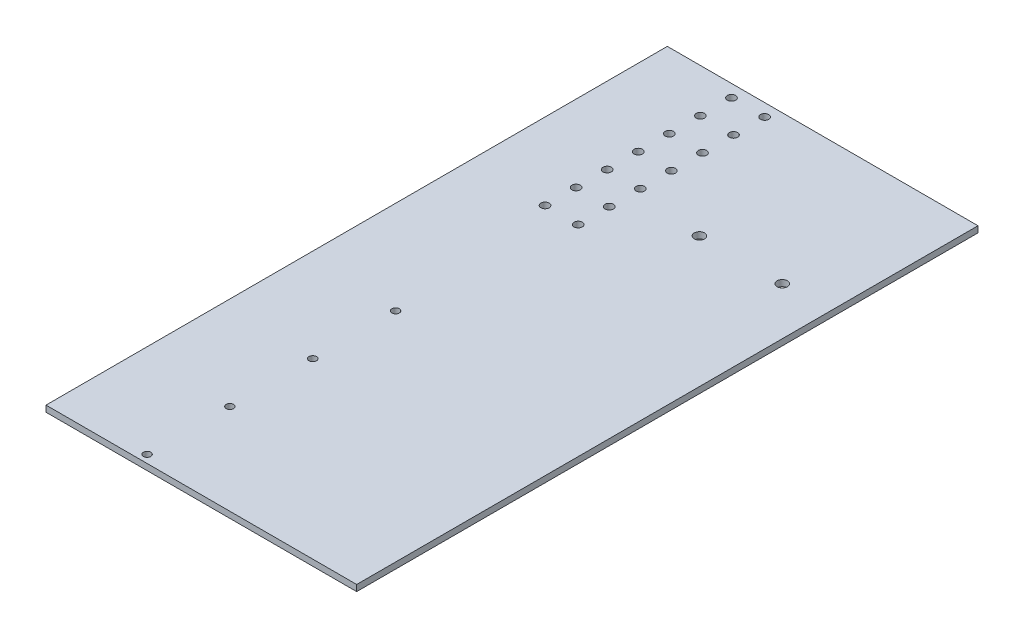
ISO-10303-21;
HEADER;
FILE_DESCRIPTION(('STEP AP214'),'2;1');
FILE_NAME('part.step','',(''),(''),'','','');
FILE_SCHEMA(('AUTOMOTIVE_DESIGN { 1 0 10303 214 1 1 1 1 }'));
ENDSEC;
DATA;
#1=APPLICATION_CONTEXT('core data for automotive mechanical design processes');
#2=APPLICATION_PROTOCOL_DEFINITION('international standard','automotive_design',2000,#1);
#3=PRODUCT_CONTEXT('',#1,'mechanical');
#4=PRODUCT('Part','Part','',(#3));
#5=PRODUCT_RELATED_PRODUCT_CATEGORY('part','',(#4));
#6=PRODUCT_DEFINITION_FORMATION('','',#4);
#7=PRODUCT_DEFINITION_CONTEXT('part definition',#1,'design');
#8=PRODUCT_DEFINITION('design','',#6,#7);
#9=PRODUCT_DEFINITION_SHAPE('','',#8);
#10=(LENGTH_UNIT() NAMED_UNIT(*) SI_UNIT(.MILLI.,.METRE.));
#11=(NAMED_UNIT(*) PLANE_ANGLE_UNIT() SI_UNIT($,.RADIAN.));
#12=(NAMED_UNIT(*) SI_UNIT($,.STERADIAN.) SOLID_ANGLE_UNIT());
#13=UNCERTAINTY_MEASURE_WITH_UNIT(LENGTH_MEASURE(1.E-05),#10,'distance_accuracy_value','');
#14=(GEOMETRIC_REPRESENTATION_CONTEXT(3) GLOBAL_UNCERTAINTY_ASSIGNED_CONTEXT((#13)) GLOBAL_UNIT_ASSIGNED_CONTEXT((#10,
#11,#12)) REPRESENTATION_CONTEXT('',''));
#15=CARTESIAN_POINT('',(0.,0.,0.));
#16=DIRECTION('',(0.,0.,1.));
#17=DIRECTION('',(1.,0.,0.));
#18=AXIS2_PLACEMENT_3D('',#15,#16,#17);
#19=CARTESIAN_POINT('',(75.,3.,150.));
#20=DIRECTION('',(-1.,0.,0.));
#21=DIRECTION('',(0.,0.,1.));
#22=AXIS2_PLACEMENT_3D('',#19,#20,#21);
#23=PLANE('',#22);
#24=DIRECTION('',(0.,0.,-1.));
#25=VECTOR('',#24,1.);
#26=CARTESIAN_POINT('',(75.,0.,150.));
#27=LINE('',#26,#25);
#28=CARTESIAN_POINT('',(75.,0.,150.));
#29=VERTEX_POINT('',#28);
#30=CARTESIAN_POINT('',(75.,0.,-150.));
#31=VERTEX_POINT('',#30);
#32=EDGE_CURVE('E109',#29,#31,#27,.T.);
#33=ORIENTED_EDGE('',*,*,#32,.T.);
#34=DIRECTION('',(0.,-1.,0.));
#35=VECTOR('',#34,1.);
#36=CARTESIAN_POINT('',(75.,3.,-150.));
#37=LINE('',#36,#35);
#38=CARTESIAN_POINT('',(75.,3.,-150.));
#39=VERTEX_POINT('',#38);
#40=EDGE_CURVE('E11',#39,#31,#37,.T.);
#41=ORIENTED_EDGE('',*,*,#40,.F.);
#42=DIRECTION('',(0.,0.,-1.));
#43=VECTOR('',#42,1.);
#44=CARTESIAN_POINT('',(75.,3.,150.));
#45=LINE('',#44,#43);
#46=CARTESIAN_POINT('',(75.,3.,150.));
#47=VERTEX_POINT('',#46);
#48=EDGE_CURVE('E92',#47,#39,#45,.T.);
#49=ORIENTED_EDGE('',*,*,#48,.F.);
#50=DIRECTION('',(0.,-1.,0.));
#51=VECTOR('',#50,1.);
#52=CARTESIAN_POINT('',(75.,3.,150.));
#53=LINE('',#52,#51);
#54=EDGE_CURVE('E105',#47,#29,#53,.T.);
#55=ORIENTED_EDGE('',*,*,#54,.T.);
#56=EDGE_LOOP('',(#33,#41,#49,#55));
#57=FACE_BOUND('',#56,.T.);
#58=ADVANCED_FACE('F38',(#57),#23,.F.);
#59=CARTESIAN_POINT('',(-75.,3.,-150.));
#60=DIRECTION('',(0.,0.,1.));
#61=DIRECTION('',(1.,0.,0.));
#62=AXIS2_PLACEMENT_3D('',#59,#60,#61);
#63=PLANE('',#62);
#64=DIRECTION('',(-1.,0.,0.));
#65=VECTOR('',#64,1.);
#66=CARTESIAN_POINT('',(-75.,0.,-150.));
#67=LINE('',#66,#65);
#68=CARTESIAN_POINT('',(-75.,0.,-150.));
#69=VERTEX_POINT('',#68);
#70=EDGE_CURVE('E97',#31,#69,#67,.T.);
#71=ORIENTED_EDGE('',*,*,#70,.T.);
#72=DIRECTION('',(0.,-1.,0.));
#73=VECTOR('',#72,1.);
#74=CARTESIAN_POINT('',(-75.,3.,-150.));
#75=LINE('',#74,#73);
#76=CARTESIAN_POINT('',(-75.,3.,-150.));
#77=VERTEX_POINT('',#76);
#78=EDGE_CURVE('E48',#77,#69,#75,.T.);
#79=ORIENTED_EDGE('',*,*,#78,.F.);
#80=DIRECTION('',(-1.,0.,0.));
#81=VECTOR('',#80,1.);
#82=CARTESIAN_POINT('',(-75.,3.,-150.));
#83=LINE('',#82,#81);
#84=EDGE_CURVE('E87',#39,#77,#83,.T.);
#85=ORIENTED_EDGE('',*,*,#84,.F.);
#86=ORIENTED_EDGE('',*,*,#40,.T.);
#87=EDGE_LOOP('',(#71,#79,#85,#86));
#88=FACE_BOUND('',#87,.T.);
#89=ADVANCED_FACE('F96',(#88),#63,.F.);
#90=CARTESIAN_POINT('',(-75.,3.,150.));
#91=DIRECTION('',(1.,0.,0.));
#92=DIRECTION('',(0.,0.,-1.));
#93=AXIS2_PLACEMENT_3D('',#90,#91,#92);
#94=PLANE('',#93);
#95=DIRECTION('',(0.,0.,1.));
#96=VECTOR('',#95,1.);
#97=CARTESIAN_POINT('',(-75.,0.,150.));
#98=LINE('',#97,#96);
#99=CARTESIAN_POINT('',(-75.,0.,150.));
#100=VERTEX_POINT('',#99);
#101=EDGE_CURVE('E74',#69,#100,#98,.T.);
#102=ORIENTED_EDGE('',*,*,#101,.T.);
#103=DIRECTION('',(0.,-1.,0.));
#104=VECTOR('',#103,1.);
#105=CARTESIAN_POINT('',(-75.,3.,150.));
#106=LINE('',#105,#104);
#107=CARTESIAN_POINT('',(-75.,3.,150.));
#108=VERTEX_POINT('',#107);
#109=EDGE_CURVE('E99',#108,#100,#106,.T.);
#110=ORIENTED_EDGE('',*,*,#109,.F.);
#111=DIRECTION('',(0.,0.,1.));
#112=VECTOR('',#111,1.);
#113=CARTESIAN_POINT('',(-75.,3.,150.));
#114=LINE('',#113,#112);
#115=EDGE_CURVE('E90',#77,#108,#114,.T.);
#116=ORIENTED_EDGE('',*,*,#115,.F.);
#117=ORIENTED_EDGE('',*,*,#78,.T.);
#118=EDGE_LOOP('',(#102,#110,#116,#117));
#119=FACE_BOUND('',#118,.T.);
#120=ADVANCED_FACE('F101',(#119),#94,.F.);
#121=CARTESIAN_POINT('',(-75.,3.,150.));
#122=DIRECTION('',(0.,0.,-1.));
#123=DIRECTION('',(-1.,0.,0.));
#124=AXIS2_PLACEMENT_3D('',#121,#122,#123);
#125=PLANE('',#124);
#126=DIRECTION('',(1.,0.,0.));
#127=VECTOR('',#126,1.);
#128=CARTESIAN_POINT('',(-75.,0.,150.));
#129=LINE('',#128,#127);
#130=EDGE_CURVE('E80',#100,#29,#129,.T.);
#131=ORIENTED_EDGE('',*,*,#130,.T.);
#132=ORIENTED_EDGE('',*,*,#54,.F.);
#133=DIRECTION('',(1.,0.,0.));
#134=VECTOR('',#133,1.);
#135=CARTESIAN_POINT('',(-75.,3.,150.));
#136=LINE('',#135,#134);
#137=EDGE_CURVE('E57',#108,#47,#136,.T.);
#138=ORIENTED_EDGE('',*,*,#137,.F.);
#139=ORIENTED_EDGE('',*,*,#109,.T.);
#140=EDGE_LOOP('',(#131,#132,#138,#139));
#141=FACE_BOUND('',#140,.T.);
#142=ADVANCED_FACE('F274',(#141),#125,.F.);
#143=CARTESIAN_POINT('',(0.,3.,0.));
#144=DIRECTION('',(0.,-1.,0.));
#145=DIRECTION('',(0.,0.,-1.));
#146=AXIS2_PLACEMENT_3D('',#143,#144,#145);
#147=PLANE('',#146);
#148=CARTESIAN_POINT('',(-22.0060480921032,3.,-98.9680858011264));
#149=DIRECTION('',(0.,1.,0.));
#150=DIRECTION('',(0.,0.,1.));
#151=AXIS2_PLACEMENT_3D('',#148,#149,#150);
#152=CIRCLE('',#151,2.);
#153=CARTESIAN_POINT('',(-22.0060480921032,3.,-96.9680858011263));
#154=VERTEX_POINT('',#153);
#155=EDGE_CURVE('E487',#154,#154,#152,.T.);
#156=ORIENTED_EDGE('',*,*,#155,.F.);
#157=EDGE_LOOP('',(#156));
#158=FACE_BOUND('',#157,.T.);
#159=CARTESIAN_POINT('',(-38.0060480921033,3.,-113.968085801126));
#160=DIRECTION('',(0.,1.,0.));
#161=DIRECTION('',(0.,0.,1.));
#162=AXIS2_PLACEMENT_3D('',#159,#160,#161);
#163=CIRCLE('',#162,2.);
#164=CARTESIAN_POINT('',(-38.0060480921033,3.,-111.968085801126));
#165=VERTEX_POINT('',#164);
#166=EDGE_CURVE('E490',#165,#165,#163,.T.);
#167=ORIENTED_EDGE('',*,*,#166,.F.);
#168=EDGE_LOOP('',(#167));
#169=FACE_BOUND('',#168,.T.);
#170=CARTESIAN_POINT('',(-22.0060480921033,3.,-113.968085801126));
#171=DIRECTION('',(0.,1.,0.));
#172=DIRECTION('',(0.,0.,1.));
#173=AXIS2_PLACEMENT_3D('',#170,#171,#172);
#174=CIRCLE('',#173,2.);
#175=CARTESIAN_POINT('',(-22.0060480921033,3.,-111.968085801126));
#176=VERTEX_POINT('',#175);
#177=EDGE_CURVE('E498',#176,#176,#174,.T.);
#178=ORIENTED_EDGE('',*,*,#177,.F.);
#179=EDGE_LOOP('',(#178));
#180=FACE_BOUND('',#179,.T.);
#181=CARTESIAN_POINT('',(-38.0060480921034,3.,-128.968085801126));
#182=DIRECTION('',(0.,1.,0.));
#183=DIRECTION('',(0.,0.,1.));
#184=AXIS2_PLACEMENT_3D('',#181,#182,#183);
#185=CIRCLE('',#184,2.);
#186=CARTESIAN_POINT('',(-38.0060480921034,3.,-126.968085801126));
#187=VERTEX_POINT('',#186);
#188=EDGE_CURVE('E501',#187,#187,#185,.T.);
#189=ORIENTED_EDGE('',*,*,#188,.F.);
#190=EDGE_LOOP('',(#189));
#191=FACE_BOUND('',#190,.T.);
#192=CARTESIAN_POINT('',(-22.0060480921031,3.,-68.9680858011264));
#193=DIRECTION('',(0.,1.,0.));
#194=DIRECTION('',(0.,0.,1.));
#195=AXIS2_PLACEMENT_3D('',#192,#193,#194);
#196=CIRCLE('',#195,2.);
#197=CARTESIAN_POINT('',(-22.0060480921031,3.,-66.9680858011263));
#198=VERTEX_POINT('',#197);
#199=EDGE_CURVE('E508',#198,#198,#196,.T.);
#200=ORIENTED_EDGE('',*,*,#199,.F.);
#201=EDGE_LOOP('',(#200));
#202=FACE_BOUND('',#201,.T.);
#203=CARTESIAN_POINT('',(-38.0060480921032,3.,-83.9680858011264));
#204=DIRECTION('',(0.,1.,0.));
#205=DIRECTION('',(0.,0.,1.));
#206=AXIS2_PLACEMENT_3D('',#203,#204,#205);
#207=CIRCLE('',#206,2.);
#208=CARTESIAN_POINT('',(-38.0060480921032,3.,-81.9680858011263));
#209=VERTEX_POINT('',#208);
#210=EDGE_CURVE('E506',#209,#209,#207,.T.);
#211=ORIENTED_EDGE('',*,*,#210,.F.);
#212=EDGE_LOOP('',(#211));
#213=FACE_BOUND('',#212,.T.);
#214=CARTESIAN_POINT('',(-22.0060480921032,3.,-83.9680858011264));
#215=DIRECTION('',(0.,1.,0.));
#216=DIRECTION('',(0.,0.,1.));
#217=AXIS2_PLACEMENT_3D('',#214,#215,#216);
#218=CIRCLE('',#217,2.);
#219=CARTESIAN_POINT('',(-22.0060480921032,3.,-81.9680858011263));
#220=VERTEX_POINT('',#219);
#221=EDGE_CURVE('E495',#220,#220,#218,.T.);
#222=ORIENTED_EDGE('',*,*,#221,.F.);
#223=EDGE_LOOP('',(#222));
#224=FACE_BOUND('',#223,.T.);
#225=CARTESIAN_POINT('',(-38.0060480921032,3.,-98.9680858011264));
#226=DIRECTION('',(0.,1.,0.));
#227=DIRECTION('',(0.,0.,1.));
#228=AXIS2_PLACEMENT_3D('',#225,#226,#227);
#229=CIRCLE('',#228,2.);
#230=CARTESIAN_POINT('',(-38.0060480921032,3.,-96.9680858011263));
#231=VERTEX_POINT('',#230);
#232=EDGE_CURVE('E489',#231,#231,#229,.T.);
#233=ORIENTED_EDGE('',*,*,#232,.F.);
#234=EDGE_LOOP('',(#233));
#235=FACE_BOUND('',#234,.T.);
#236=CARTESIAN_POINT('',(-22.0060480921034,3.,-143.968085801126));
#237=DIRECTION('',(0.,1.,0.));
#238=DIRECTION('',(0.,0.,1.));
#239=AXIS2_PLACEMENT_3D('',#236,#237,#238);
#240=CIRCLE('',#239,2.);
#241=CARTESIAN_POINT('',(-22.0060480921034,3.,-141.968085801126));
#242=VERTEX_POINT('',#241);
#243=EDGE_CURVE('E546',#242,#242,#240,.T.);
#244=ORIENTED_EDGE('',*,*,#243,.F.);
#245=EDGE_LOOP('',(#244));
#246=FACE_BOUND('',#245,.T.);
#247=CARTESIAN_POINT('',(-38.0060480921034,3.,-143.968085801126));
#248=DIRECTION('',(0.,1.,0.));
#249=DIRECTION('',(0.,0.,1.));
#250=AXIS2_PLACEMENT_3D('',#247,#248,#249);
#251=CIRCLE('',#250,2.);
#252=CARTESIAN_POINT('',(-38.0060480921034,3.,-141.968085801126));
#253=VERTEX_POINT('',#252);
#254=EDGE_CURVE('E550',#253,#253,#251,.T.);
#255=ORIENTED_EDGE('',*,*,#254,.F.);
#256=EDGE_LOOP('',(#255));
#257=FACE_BOUND('',#256,.T.);
#258=CARTESIAN_POINT('',(-22.0060480921033,3.,-128.968085801126));
#259=DIRECTION('',(0.,1.,0.));
#260=DIRECTION('',(0.,0.,1.));
#261=AXIS2_PLACEMENT_3D('',#258,#259,#260);
#262=CIRCLE('',#261,2.);
#263=CARTESIAN_POINT('',(-22.0060480921033,3.,-126.968085801126));
#264=VERTEX_POINT('',#263);
#265=EDGE_CURVE('E553',#264,#264,#262,.T.);
#266=ORIENTED_EDGE('',*,*,#265,.F.);
#267=EDGE_LOOP('',(#266));
#268=FACE_BOUND('',#267,.T.);
#269=CARTESIAN_POINT('',(-38.0060480921031,3.,-68.9680858011264));
#270=DIRECTION('',(0.,1.,0.));
#271=DIRECTION('',(0.,0.,1.));
#272=AXIS2_PLACEMENT_3D('',#269,#270,#271);
#273=CIRCLE('',#272,2.);
#274=CARTESIAN_POINT('',(-38.0060480921031,3.,-66.9680858011263));
#275=VERTEX_POINT('',#274);
#276=EDGE_CURVE('E157',#275,#275,#273,.T.);
#277=ORIENTED_EDGE('',*,*,#276,.F.);
#278=EDGE_LOOP('',(#277));
#279=FACE_BOUND('',#278,.T.);
#280=CARTESIAN_POINT('',(-38.0060480921031,3.,-53.9680858011264));
#281=DIRECTION('',(0.,1.,0.));
#282=DIRECTION('',(0.,0.,1.));
#283=AXIS2_PLACEMENT_3D('',#280,#281,#282);
#284=CIRCLE('',#283,2.);
#285=CARTESIAN_POINT('',(-38.0060480921031,3.,-51.9680858011264));
#286=VERTEX_POINT('',#285);
#287=EDGE_CURVE('E147',#286,#286,#284,.T.);
#288=ORIENTED_EDGE('',*,*,#287,.F.);
#289=EDGE_LOOP('',(#288));
#290=FACE_BOUND('',#289,.T.);
#291=CARTESIAN_POINT('',(-22.0060480921031,3.,-53.9680858011264));
#292=DIRECTION('',(0.,1.,0.));
#293=DIRECTION('',(0.,0.,1.));
#294=AXIS2_PLACEMENT_3D('',#291,#292,#293);
#295=CIRCLE('',#294,2.);
#296=CARTESIAN_POINT('',(-22.0060480921031,3.,-51.9680858011264));
#297=VERTEX_POINT('',#296);
#298=EDGE_CURVE('E199',#297,#297,#295,.T.);
#299=ORIENTED_EDGE('',*,*,#298,.F.);
#300=EDGE_LOOP('',(#299));
#301=FACE_BOUND('',#300,.T.);
#302=CARTESIAN_POINT('',(-30.0060480921029,3.,146.200000000003));
#303=DIRECTION('',(0.,1.,0.));
#304=DIRECTION('',(0.,0.,1.));
#305=AXIS2_PLACEMENT_3D('',#302,#303,#304);
#306=CIRCLE('',#305,1.79999999999999);
#307=CARTESIAN_POINT('',(-30.0060480921029,3.,148.000000000003));
#308=VERTEX_POINT('',#307);
#309=EDGE_CURVE('E129',#308,#308,#306,.T.);
#310=ORIENTED_EDGE('',*,*,#309,.F.);
#311=EDGE_LOOP('',(#310));
#312=FACE_BOUND('',#311,.T.);
#313=CARTESIAN_POINT('',(-30.0060480921033,3.,106.200000000003));
#314=DIRECTION('',(0.,1.,0.));
#315=DIRECTION('',(0.,0.,1.));
#316=AXIS2_PLACEMENT_3D('',#313,#314,#315);
#317=CIRCLE('',#316,1.79999999999999);
#318=CARTESIAN_POINT('',(-30.0060480921033,3.,108.000000000003));
#319=VERTEX_POINT('',#318);
#320=EDGE_CURVE('E215',#319,#319,#317,.T.);
#321=ORIENTED_EDGE('',*,*,#320,.F.);
#322=EDGE_LOOP('',(#321));
#323=FACE_BOUND('',#322,.T.);
#324=CARTESIAN_POINT('',(-30.0060480921037,3.,66.2000000000026));
#325=DIRECTION('',(0.,1.,0.));
#326=DIRECTION('',(0.,0.,1.));
#327=AXIS2_PLACEMENT_3D('',#324,#325,#326);
#328=CIRCLE('',#327,1.79999999999999);
#329=CARTESIAN_POINT('',(-30.0060480921037,3.,68.0000000000026));
#330=VERTEX_POINT('',#329);
#331=EDGE_CURVE('E219',#330,#330,#328,.T.);
#332=ORIENTED_EDGE('',*,*,#331,.F.);
#333=EDGE_LOOP('',(#332));
#334=FACE_BOUND('',#333,.T.);
#335=CARTESIAN_POINT('',(-30.0060480921042,3.,26.2000000000026));
#336=DIRECTION('',(0.,1.,0.));
#337=DIRECTION('',(0.,0.,1.));
#338=AXIS2_PLACEMENT_3D('',#335,#336,#337);
#339=CIRCLE('',#338,1.79999999999999);
#340=CARTESIAN_POINT('',(-30.0060480921042,3.,28.0000000000026));
#341=VERTEX_POINT('',#340);
#342=EDGE_CURVE('E151',#341,#341,#339,.T.);
#343=ORIENTED_EDGE('',*,*,#342,.F.);
#344=EDGE_LOOP('',(#343));
#345=FACE_BOUND('',#344,.T.);
#346=CARTESIAN_POINT('',(51.9999999999985,3.,-78.499999999999));
#347=DIRECTION('',(0.,-1.,0.));
#348=DIRECTION('',(0.,0.,-1.));
#349=AXIS2_PLACEMENT_3D('',#346,#347,#348);
#350=CIRCLE('',#349,2.5);
#351=CARTESIAN_POINT('',(51.9999999999985,3.,-80.999999999999));
#352=VERTEX_POINT('',#351);
#353=EDGE_CURVE('E113',#352,#352,#350,.T.);
#354=ORIENTED_EDGE('',*,*,#353,.T.);
#355=EDGE_LOOP('',(#354));
#356=FACE_BOUND('',#355,.T.);
#357=CARTESIAN_POINT('',(11.9999999999983,3.,-78.499999999999));
#358=DIRECTION('',(0.,-1.,0.));
#359=DIRECTION('',(0.,0.,-1.));
#360=AXIS2_PLACEMENT_3D('',#357,#358,#359);
#361=CIRCLE('',#360,2.5);
#362=CARTESIAN_POINT('',(11.9999999999983,3.,-80.999999999999));
#363=VERTEX_POINT('',#362);
#364=EDGE_CURVE('E230',#363,#363,#361,.T.);
#365=ORIENTED_EDGE('',*,*,#364,.T.);
#366=EDGE_LOOP('',(#365));
#367=FACE_BOUND('',#366,.T.);
#368=ORIENTED_EDGE('',*,*,#48,.T.);
#369=ORIENTED_EDGE('',*,*,#84,.T.);
#370=ORIENTED_EDGE('',*,*,#115,.T.);
#371=ORIENTED_EDGE('',*,*,#137,.T.);
#372=EDGE_LOOP('',(#368,#369,#370,#371));
#373=FACE_BOUND('',#372,.T.);
#374=ADVANCED_FACE('F88',(#158,#169,#180,#191,#202,#213,#224,#235,#246,#257,#268,#279,#290,#301,
#312,#323,#334,#345,#356,#367,#373),#147,.F.);
#375=CARTESIAN_POINT('',(0.,0.,0.));
#376=DIRECTION('',(0.,-1.,0.));
#377=DIRECTION('',(0.,0.,-1.));
#378=AXIS2_PLACEMENT_3D('',#375,#376,#377);
#379=PLANE('',#378);
#380=CARTESIAN_POINT('',(-22.0060480921032,0.,-98.9680858011264));
#381=DIRECTION('',(0.,-1.,0.));
#382=DIRECTION('',(0.,0.,-1.));
#383=AXIS2_PLACEMENT_3D('',#380,#381,#382);
#384=CIRCLE('',#383,2.);
#385=CARTESIAN_POINT('',(-22.0060480921032,0.,-100.968085801126));
#386=VERTEX_POINT('',#385);
#387=EDGE_CURVE('E41',#386,#386,#384,.T.);
#388=ORIENTED_EDGE('',*,*,#387,.F.);
#389=EDGE_LOOP('',(#388));
#390=FACE_BOUND('',#389,.T.);
#391=CARTESIAN_POINT('',(-38.0060480921033,0.,-113.968085801126));
#392=DIRECTION('',(0.,-1.,0.));
#393=DIRECTION('',(0.,0.,-1.));
#394=AXIS2_PLACEMENT_3D('',#391,#392,#393);
#395=CIRCLE('',#394,2.);
#396=CARTESIAN_POINT('',(-38.0060480921033,0.,-115.968085801126));
#397=VERTEX_POINT('',#396);
#398=EDGE_CURVE('E192',#397,#397,#395,.T.);
#399=ORIENTED_EDGE('',*,*,#398,.F.);
#400=EDGE_LOOP('',(#399));
#401=FACE_BOUND('',#400,.T.);
#402=CARTESIAN_POINT('',(-22.0060480921033,0.,-113.968085801126));
#403=DIRECTION('',(0.,-1.,0.));
#404=DIRECTION('',(0.,0.,-1.));
#405=AXIS2_PLACEMENT_3D('',#402,#403,#404);
#406=CIRCLE('',#405,2.);
#407=CARTESIAN_POINT('',(-22.0060480921033,0.,-115.968085801126));
#408=VERTEX_POINT('',#407);
#409=EDGE_CURVE('E189',#408,#408,#406,.T.);
#410=ORIENTED_EDGE('',*,*,#409,.F.);
#411=EDGE_LOOP('',(#410));
#412=FACE_BOUND('',#411,.T.);
#413=CARTESIAN_POINT('',(-38.0060480921034,0.,-128.968085801126));
#414=DIRECTION('',(0.,-1.,0.));
#415=DIRECTION('',(0.,0.,-1.));
#416=AXIS2_PLACEMENT_3D('',#413,#414,#415);
#417=CIRCLE('',#416,2.);
#418=CARTESIAN_POINT('',(-38.0060480921034,0.,-130.968085801126));
#419=VERTEX_POINT('',#418);
#420=EDGE_CURVE('E185',#419,#419,#417,.T.);
#421=ORIENTED_EDGE('',*,*,#420,.F.);
#422=EDGE_LOOP('',(#421));
#423=FACE_BOUND('',#422,.T.);
#424=CARTESIAN_POINT('',(-22.0060480921031,0.,-68.9680858011264));
#425=DIRECTION('',(0.,-1.,0.));
#426=DIRECTION('',(0.,0.,-1.));
#427=AXIS2_PLACEMENT_3D('',#424,#425,#426);
#428=CIRCLE('',#427,2.);
#429=CARTESIAN_POINT('',(-22.0060480921031,0.,-70.9680858011264));
#430=VERTEX_POINT('',#429);
#431=EDGE_CURVE('E181',#430,#430,#428,.T.);
#432=ORIENTED_EDGE('',*,*,#431,.F.);
#433=EDGE_LOOP('',(#432));
#434=FACE_BOUND('',#433,.T.);
#435=CARTESIAN_POINT('',(-38.0060480921032,0.,-83.9680858011264));
#436=DIRECTION('',(0.,-1.,0.));
#437=DIRECTION('',(0.,0.,-1.));
#438=AXIS2_PLACEMENT_3D('',#435,#436,#437);
#439=CIRCLE('',#438,2.);
#440=CARTESIAN_POINT('',(-38.0060480921032,0.,-85.9680858011264));
#441=VERTEX_POINT('',#440);
#442=EDGE_CURVE('E177',#441,#441,#439,.T.);
#443=ORIENTED_EDGE('',*,*,#442,.F.);
#444=EDGE_LOOP('',(#443));
#445=FACE_BOUND('',#444,.T.);
#446=CARTESIAN_POINT('',(-22.0060480921032,0.,-83.9680858011264));
#447=DIRECTION('',(0.,-1.,0.));
#448=DIRECTION('',(0.,0.,-1.));
#449=AXIS2_PLACEMENT_3D('',#446,#447,#448);
#450=CIRCLE('',#449,2.);
#451=CARTESIAN_POINT('',(-22.0060480921032,0.,-85.9680858011264));
#452=VERTEX_POINT('',#451);
#453=EDGE_CURVE('E173',#452,#452,#450,.T.);
#454=ORIENTED_EDGE('',*,*,#453,.F.);
#455=EDGE_LOOP('',(#454));
#456=FACE_BOUND('',#455,.T.);
#457=CARTESIAN_POINT('',(-38.0060480921032,0.,-98.9680858011264));
#458=DIRECTION('',(0.,-1.,0.));
#459=DIRECTION('',(0.,0.,-1.));
#460=AXIS2_PLACEMENT_3D('',#457,#458,#459);
#461=CIRCLE('',#460,2.);
#462=CARTESIAN_POINT('',(-38.0060480921032,0.,-100.968085801126));
#463=VERTEX_POINT('',#462);
#464=EDGE_CURVE('E169',#463,#463,#461,.T.);
#465=ORIENTED_EDGE('',*,*,#464,.F.);
#466=EDGE_LOOP('',(#465));
#467=FACE_BOUND('',#466,.T.);
#468=CARTESIAN_POINT('',(-22.0060480921034,0.,-143.968085801126));
#469=DIRECTION('',(0.,-1.,0.));
#470=DIRECTION('',(0.,0.,-1.));
#471=AXIS2_PLACEMENT_3D('',#468,#469,#470);
#472=CIRCLE('',#471,2.);
#473=CARTESIAN_POINT('',(-22.0060480921034,0.,-145.968085801126));
#474=VERTEX_POINT('',#473);
#475=EDGE_CURVE('E165',#474,#474,#472,.T.);
#476=ORIENTED_EDGE('',*,*,#475,.F.);
#477=EDGE_LOOP('',(#476));
#478=FACE_BOUND('',#477,.T.);
#479=CARTESIAN_POINT('',(-38.0060480921034,0.,-143.968085801126));
#480=DIRECTION('',(0.,-1.,0.));
#481=DIRECTION('',(0.,0.,-1.));
#482=AXIS2_PLACEMENT_3D('',#479,#480,#481);
#483=CIRCLE('',#482,2.);
#484=CARTESIAN_POINT('',(-38.0060480921034,0.,-145.968085801126));
#485=VERTEX_POINT('',#484);
#486=EDGE_CURVE('E161',#485,#485,#483,.T.);
#487=ORIENTED_EDGE('',*,*,#486,.F.);
#488=EDGE_LOOP('',(#487));
#489=FACE_BOUND('',#488,.T.);
#490=CARTESIAN_POINT('',(-22.0060480921033,0.,-128.968085801126));
#491=DIRECTION('',(0.,-1.,0.));
#492=DIRECTION('',(0.,0.,-1.));
#493=AXIS2_PLACEMENT_3D('',#490,#491,#492);
#494=CIRCLE('',#493,2.);
#495=CARTESIAN_POINT('',(-22.0060480921033,0.,-130.968085801126));
#496=VERTEX_POINT('',#495);
#497=EDGE_CURVE('E156',#496,#496,#494,.T.);
#498=ORIENTED_EDGE('',*,*,#497,.F.);
#499=EDGE_LOOP('',(#498));
#500=FACE_BOUND('',#499,.T.);
#501=CARTESIAN_POINT('',(-38.0060480921031,0.,-68.9680858011264));
#502=DIRECTION('',(0.,-1.,0.));
#503=DIRECTION('',(0.,0.,-1.));
#504=AXIS2_PLACEMENT_3D('',#501,#502,#503);
#505=CIRCLE('',#504,2.);
#506=CARTESIAN_POINT('',(-38.0060480921031,0.,-70.9680858011264));
#507=VERTEX_POINT('',#506);
#508=EDGE_CURVE('E152',#507,#507,#505,.T.);
#509=ORIENTED_EDGE('',*,*,#508,.F.);
#510=EDGE_LOOP('',(#509));
#511=FACE_BOUND('',#510,.T.);
#512=CARTESIAN_POINT('',(-38.0060480921031,0.,-53.9680858011264));
#513=DIRECTION('',(0.,-1.,0.));
#514=DIRECTION('',(0.,0.,-1.));
#515=AXIS2_PLACEMENT_3D('',#512,#513,#514);
#516=CIRCLE('',#515,2.);
#517=CARTESIAN_POINT('',(-38.0060480921031,0.,-55.9680858011264));
#518=VERTEX_POINT('',#517);
#519=EDGE_CURVE('E146',#518,#518,#516,.T.);
#520=ORIENTED_EDGE('',*,*,#519,.F.);
#521=EDGE_LOOP('',(#520));
#522=FACE_BOUND('',#521,.T.);
#523=CARTESIAN_POINT('',(-22.0060480921031,0.,-53.9680858011264));
#524=DIRECTION('',(0.,-1.,0.));
#525=DIRECTION('',(0.,0.,-1.));
#526=AXIS2_PLACEMENT_3D('',#523,#524,#525);
#527=CIRCLE('',#526,2.);
#528=CARTESIAN_POINT('',(-22.0060480921031,0.,-55.9680858011264));
#529=VERTEX_POINT('',#528);
#530=EDGE_CURVE('E142',#529,#529,#527,.T.);
#531=ORIENTED_EDGE('',*,*,#530,.F.);
#532=EDGE_LOOP('',(#531));
#533=FACE_BOUND('',#532,.T.);
#534=CARTESIAN_POINT('',(-30.0060480921029,0.,146.200000000003));
#535=DIRECTION('',(0.,-1.,0.));
#536=DIRECTION('',(0.,0.,-1.));
#537=AXIS2_PLACEMENT_3D('',#534,#535,#536);
#538=CIRCLE('',#537,1.79999999999999);
#539=CARTESIAN_POINT('',(-30.0060480921029,0.,144.400000000003));
#540=VERTEX_POINT('',#539);
#541=EDGE_CURVE('E137',#540,#540,#538,.T.);
#542=ORIENTED_EDGE('',*,*,#541,.F.);
#543=EDGE_LOOP('',(#542));
#544=FACE_BOUND('',#543,.T.);
#545=CARTESIAN_POINT('',(-30.0060480921033,0.,106.200000000003));
#546=DIRECTION('',(0.,-1.,0.));
#547=DIRECTION('',(0.,0.,-1.));
#548=AXIS2_PLACEMENT_3D('',#545,#546,#547);
#549=CIRCLE('',#548,1.79999999999999);
#550=CARTESIAN_POINT('',(-30.0060480921033,0.,104.400000000003));
#551=VERTEX_POINT('',#550);
#552=EDGE_CURVE('E133',#551,#551,#549,.T.);
#553=ORIENTED_EDGE('',*,*,#552,.F.);
#554=EDGE_LOOP('',(#553));
#555=FACE_BOUND('',#554,.T.);
#556=CARTESIAN_POINT('',(-30.0060480921037,0.,66.2000000000026));
#557=DIRECTION('',(0.,-1.,0.));
#558=DIRECTION('',(0.,0.,-1.));
#559=AXIS2_PLACEMENT_3D('',#556,#557,#558);
#560=CIRCLE('',#559,1.79999999999999);
#561=CARTESIAN_POINT('',(-30.0060480921037,0.,64.4000000000026));
#562=VERTEX_POINT('',#561);
#563=EDGE_CURVE('E128',#562,#562,#560,.T.);
#564=ORIENTED_EDGE('',*,*,#563,.F.);
#565=EDGE_LOOP('',(#564));
#566=FACE_BOUND('',#565,.T.);
#567=CARTESIAN_POINT('',(-30.0060480921042,0.,26.2000000000026));
#568=DIRECTION('',(0.,-1.,0.));
#569=DIRECTION('',(0.,0.,-1.));
#570=AXIS2_PLACEMENT_3D('',#567,#568,#569);
#571=CIRCLE('',#570,1.79999999999999);
#572=CARTESIAN_POINT('',(-30.0060480921042,0.,24.4000000000026));
#573=VERTEX_POINT('',#572);
#574=EDGE_CURVE('E124',#573,#573,#571,.T.);
#575=ORIENTED_EDGE('',*,*,#574,.F.);
#576=EDGE_LOOP('',(#575));
#577=FACE_BOUND('',#576,.T.);
#578=CARTESIAN_POINT('',(51.9999999999985,0.,-78.499999999999));
#579=DIRECTION('',(0.,-1.,0.));
#580=DIRECTION('',(0.,0.,-1.));
#581=AXIS2_PLACEMENT_3D('',#578,#579,#580);
#582=CIRCLE('',#581,2.5);
#583=CARTESIAN_POINT('',(51.9999999999985,0.,-80.999999999999));
#584=VERTEX_POINT('',#583);
#585=EDGE_CURVE('E226',#584,#584,#582,.T.);
#586=ORIENTED_EDGE('',*,*,#585,.F.);
#587=EDGE_LOOP('',(#586));
#588=FACE_BOUND('',#587,.T.);
#589=CARTESIAN_POINT('',(11.9999999999983,0.,-78.499999999999));
#590=DIRECTION('',(0.,-1.,0.));
#591=DIRECTION('',(0.,0.,-1.));
#592=AXIS2_PLACEMENT_3D('',#589,#590,#591);
#593=CIRCLE('',#592,2.5);
#594=CARTESIAN_POINT('',(11.9999999999983,0.,-80.999999999999));
#595=VERTEX_POINT('',#594);
#596=EDGE_CURVE('E141',#595,#595,#593,.T.);
#597=ORIENTED_EDGE('',*,*,#596,.F.);
#598=EDGE_LOOP('',(#597));
#599=FACE_BOUND('',#598,.T.);
#600=ORIENTED_EDGE('',*,*,#32,.F.);
#601=ORIENTED_EDGE('',*,*,#130,.F.);
#602=ORIENTED_EDGE('',*,*,#101,.F.);
#603=ORIENTED_EDGE('',*,*,#70,.F.);
#604=EDGE_LOOP('',(#600,#601,#602,#603));
#605=FACE_BOUND('',#604,.T.);
#606=ADVANCED_FACE('F257',(#390,#401,#412,#423,#434,#445,#456,#467,#478,#489,#500,#511,#522,
#533,#544,#555,#566,#577,#588,#599,#605),#379,.T.);
#607=CARTESIAN_POINT('',(11.9999999999983,10.,-78.499999999999));
#608=DIRECTION('',(0.,-1.,0.));
#609=DIRECTION('',(0.,0.,-1.));
#610=AXIS2_PLACEMENT_3D('',#607,#608,#609);
#611=CYLINDRICAL_SURFACE('',#610,2.5);
#612=ORIENTED_EDGE('',*,*,#596,.T.);
#613=EDGE_LOOP('',(#612));
#614=FACE_BOUND('',#613,.T.);
#615=ORIENTED_EDGE('',*,*,#364,.F.);
#616=EDGE_LOOP('',(#615));
#617=FACE_BOUND('',#616,.T.);
#618=ADVANCED_FACE('F247',(#614,#617),#611,.F.);
#619=CARTESIAN_POINT('',(51.9999999999985,10.,-78.499999999999));
#620=DIRECTION('',(0.,-1.,0.));
#621=DIRECTION('',(0.,0.,-1.));
#622=AXIS2_PLACEMENT_3D('',#619,#620,#621);
#623=CYLINDRICAL_SURFACE('',#622,2.5);
#624=ORIENTED_EDGE('',*,*,#585,.T.);
#625=EDGE_LOOP('',(#624));
#626=FACE_BOUND('',#625,.T.);
#627=ORIENTED_EDGE('',*,*,#353,.F.);
#628=EDGE_LOOP('',(#627));
#629=FACE_BOUND('',#628,.T.);
#630=ADVANCED_FACE('F244',(#626,#629),#623,.F.);
#631=CARTESIAN_POINT('',(-30.0060480921042,-7.,26.2000000000026));
#632=DIRECTION('',(0.,1.,0.));
#633=DIRECTION('',(0.,0.,1.));
#634=AXIS2_PLACEMENT_3D('',#631,#632,#633);
#635=CYLINDRICAL_SURFACE('',#634,1.79999999999999);
#636=ORIENTED_EDGE('',*,*,#574,.T.);
#637=EDGE_LOOP('',(#636));
#638=FACE_BOUND('',#637,.T.);
#639=ORIENTED_EDGE('',*,*,#342,.T.);
#640=EDGE_LOOP('',(#639));
#641=FACE_BOUND('',#640,.T.);
#642=ADVANCED_FACE('F246',(#638,#641),#635,.F.);
#643=CARTESIAN_POINT('',(-30.0060480921037,-7.,66.2000000000026));
#644=DIRECTION('',(0.,1.,0.));
#645=DIRECTION('',(0.,0.,1.));
#646=AXIS2_PLACEMENT_3D('',#643,#644,#645);
#647=CYLINDRICAL_SURFACE('',#646,1.79999999999999);
#648=ORIENTED_EDGE('',*,*,#563,.T.);
#649=EDGE_LOOP('',(#648));
#650=FACE_BOUND('',#649,.T.);
#651=ORIENTED_EDGE('',*,*,#331,.T.);
#652=EDGE_LOOP('',(#651));
#653=FACE_BOUND('',#652,.T.);
#654=ADVANCED_FACE('F254',(#650,#653),#647,.F.);
#655=CARTESIAN_POINT('',(-30.0060480921033,-7.,106.200000000003));
#656=DIRECTION('',(0.,1.,0.));
#657=DIRECTION('',(0.,0.,1.));
#658=AXIS2_PLACEMENT_3D('',#655,#656,#657);
#659=CYLINDRICAL_SURFACE('',#658,1.79999999999999);
#660=ORIENTED_EDGE('',*,*,#552,.T.);
#661=EDGE_LOOP('',(#660));
#662=FACE_BOUND('',#661,.T.);
#663=ORIENTED_EDGE('',*,*,#320,.T.);
#664=EDGE_LOOP('',(#663));
#665=FACE_BOUND('',#664,.T.);
#666=ADVANCED_FACE('F324',(#662,#665),#659,.F.);
#667=CARTESIAN_POINT('',(-30.0060480921029,-7.,146.200000000003));
#668=DIRECTION('',(0.,1.,0.));
#669=DIRECTION('',(0.,0.,1.));
#670=AXIS2_PLACEMENT_3D('',#667,#668,#669);
#671=CYLINDRICAL_SURFACE('',#670,1.79999999999999);
#672=ORIENTED_EDGE('',*,*,#541,.T.);
#673=EDGE_LOOP('',(#672));
#674=FACE_BOUND('',#673,.T.);
#675=ORIENTED_EDGE('',*,*,#309,.T.);
#676=EDGE_LOOP('',(#675));
#677=FACE_BOUND('',#676,.T.);
#678=ADVANCED_FACE('F334',(#674,#677),#671,.F.);
#679=CARTESIAN_POINT('',(-22.0060480921031,-5.5,-53.9680858011264));
#680=DIRECTION('',(0.,1.,0.));
#681=DIRECTION('',(0.,0.,1.));
#682=AXIS2_PLACEMENT_3D('',#679,#680,#681);
#683=CYLINDRICAL_SURFACE('',#682,2.);
#684=ORIENTED_EDGE('',*,*,#530,.T.);
#685=EDGE_LOOP('',(#684));
#686=FACE_BOUND('',#685,.T.);
#687=ORIENTED_EDGE('',*,*,#298,.T.);
#688=EDGE_LOOP('',(#687));
#689=FACE_BOUND('',#688,.T.);
#690=ADVANCED_FACE('F344',(#686,#689),#683,.F.);
#691=CARTESIAN_POINT('',(-38.0060480921031,-5.5,-53.9680858011264));
#692=DIRECTION('',(0.,1.,0.));
#693=DIRECTION('',(0.,0.,1.));
#694=AXIS2_PLACEMENT_3D('',#691,#692,#693);
#695=CYLINDRICAL_SURFACE('',#694,2.);
#696=ORIENTED_EDGE('',*,*,#519,.T.);
#697=EDGE_LOOP('',(#696));
#698=FACE_BOUND('',#697,.T.);
#699=ORIENTED_EDGE('',*,*,#287,.T.);
#700=EDGE_LOOP('',(#699));
#701=FACE_BOUND('',#700,.T.);
#702=ADVANCED_FACE('F353',(#698,#701),#695,.F.);
#703=CARTESIAN_POINT('',(-38.0060480921031,-7.,-68.9680858011264));
#704=DIRECTION('',(0.,1.,0.));
#705=DIRECTION('',(0.,0.,1.));
#706=AXIS2_PLACEMENT_3D('',#703,#704,#705);
#707=CYLINDRICAL_SURFACE('',#706,2.);
#708=ORIENTED_EDGE('',*,*,#508,.T.);
#709=EDGE_LOOP('',(#708));
#710=FACE_BOUND('',#709,.T.);
#711=ORIENTED_EDGE('',*,*,#276,.T.);
#712=EDGE_LOOP('',(#711));
#713=FACE_BOUND('',#712,.T.);
#714=ADVANCED_FACE('F362',(#710,#713),#707,.F.);
#715=CARTESIAN_POINT('',(-22.0060480921033,-7.,-128.968085801126));
#716=DIRECTION('',(0.,1.,0.));
#717=DIRECTION('',(0.,0.,1.));
#718=AXIS2_PLACEMENT_3D('',#715,#716,#717);
#719=CYLINDRICAL_SURFACE('',#718,2.);
#720=ORIENTED_EDGE('',*,*,#497,.T.);
#721=EDGE_LOOP('',(#720));
#722=FACE_BOUND('',#721,.T.);
#723=ORIENTED_EDGE('',*,*,#265,.T.);
#724=EDGE_LOOP('',(#723));
#725=FACE_BOUND('',#724,.T.);
#726=ADVANCED_FACE('F372',(#722,#725),#719,.F.);
#727=CARTESIAN_POINT('',(-38.0060480921034,-7.,-143.968085801126));
#728=DIRECTION('',(0.,1.,0.));
#729=DIRECTION('',(0.,0.,1.));
#730=AXIS2_PLACEMENT_3D('',#727,#728,#729);
#731=CYLINDRICAL_SURFACE('',#730,2.);
#732=ORIENTED_EDGE('',*,*,#486,.T.);
#733=EDGE_LOOP('',(#732));
#734=FACE_BOUND('',#733,.T.);
#735=ORIENTED_EDGE('',*,*,#254,.T.);
#736=EDGE_LOOP('',(#735));
#737=FACE_BOUND('',#736,.T.);
#738=ADVANCED_FACE('F379',(#734,#737),#731,.F.);
#739=CARTESIAN_POINT('',(-22.0060480921034,-7.,-143.968085801126));
#740=DIRECTION('',(0.,1.,0.));
#741=DIRECTION('',(0.,0.,1.));
#742=AXIS2_PLACEMENT_3D('',#739,#740,#741);
#743=CYLINDRICAL_SURFACE('',#742,2.);
#744=ORIENTED_EDGE('',*,*,#475,.T.);
#745=EDGE_LOOP('',(#744));
#746=FACE_BOUND('',#745,.T.);
#747=ORIENTED_EDGE('',*,*,#243,.T.);
#748=EDGE_LOOP('',(#747));
#749=FACE_BOUND('',#748,.T.);
#750=ADVANCED_FACE('F387',(#746,#749),#743,.F.);
#751=CARTESIAN_POINT('',(-38.0060480921032,-7.,-98.9680858011264));
#752=DIRECTION('',(0.,1.,0.));
#753=DIRECTION('',(0.,0.,1.));
#754=AXIS2_PLACEMENT_3D('',#751,#752,#753);
#755=CYLINDRICAL_SURFACE('',#754,2.);
#756=ORIENTED_EDGE('',*,*,#464,.T.);
#757=EDGE_LOOP('',(#756));
#758=FACE_BOUND('',#757,.T.);
#759=ORIENTED_EDGE('',*,*,#232,.T.);
#760=EDGE_LOOP('',(#759));
#761=FACE_BOUND('',#760,.T.);
#762=ADVANCED_FACE('F395',(#758,#761),#755,.F.);
#763=CARTESIAN_POINT('',(-22.0060480921032,-7.,-83.9680858011264));
#764=DIRECTION('',(0.,1.,0.));
#765=DIRECTION('',(0.,0.,1.));
#766=AXIS2_PLACEMENT_3D('',#763,#764,#765);
#767=CYLINDRICAL_SURFACE('',#766,2.);
#768=ORIENTED_EDGE('',*,*,#453,.T.);
#769=EDGE_LOOP('',(#768));
#770=FACE_BOUND('',#769,.T.);
#771=ORIENTED_EDGE('',*,*,#221,.T.);
#772=EDGE_LOOP('',(#771));
#773=FACE_BOUND('',#772,.T.);
#774=ADVANCED_FACE('F403',(#770,#773),#767,.F.);
#775=CARTESIAN_POINT('',(-38.0060480921032,-7.,-83.9680858011264));
#776=DIRECTION('',(0.,1.,0.));
#777=DIRECTION('',(0.,0.,1.));
#778=AXIS2_PLACEMENT_3D('',#775,#776,#777);
#779=CYLINDRICAL_SURFACE('',#778,2.);
#780=ORIENTED_EDGE('',*,*,#442,.T.);
#781=EDGE_LOOP('',(#780));
#782=FACE_BOUND('',#781,.T.);
#783=ORIENTED_EDGE('',*,*,#210,.T.);
#784=EDGE_LOOP('',(#783));
#785=FACE_BOUND('',#784,.T.);
#786=ADVANCED_FACE('F411',(#782,#785),#779,.F.);
#787=CARTESIAN_POINT('',(-22.0060480921031,-7.,-68.9680858011264));
#788=DIRECTION('',(0.,1.,0.));
#789=DIRECTION('',(0.,0.,1.));
#790=AXIS2_PLACEMENT_3D('',#787,#788,#789);
#791=CYLINDRICAL_SURFACE('',#790,2.);
#792=ORIENTED_EDGE('',*,*,#431,.T.);
#793=EDGE_LOOP('',(#792));
#794=FACE_BOUND('',#793,.T.);
#795=ORIENTED_EDGE('',*,*,#199,.T.);
#796=EDGE_LOOP('',(#795));
#797=FACE_BOUND('',#796,.T.);
#798=ADVANCED_FACE('F419',(#794,#797),#791,.F.);
#799=CARTESIAN_POINT('',(-38.0060480921034,-7.,-128.968085801126));
#800=DIRECTION('',(0.,1.,0.));
#801=DIRECTION('',(0.,0.,1.));
#802=AXIS2_PLACEMENT_3D('',#799,#800,#801);
#803=CYLINDRICAL_SURFACE('',#802,2.);
#804=ORIENTED_EDGE('',*,*,#420,.T.);
#805=EDGE_LOOP('',(#804));
#806=FACE_BOUND('',#805,.T.);
#807=ORIENTED_EDGE('',*,*,#188,.T.);
#808=EDGE_LOOP('',(#807));
#809=FACE_BOUND('',#808,.T.);
#810=ADVANCED_FACE('F427',(#806,#809),#803,.F.);
#811=CARTESIAN_POINT('',(-22.0060480921033,-7.,-113.968085801126));
#812=DIRECTION('',(0.,1.,0.));
#813=DIRECTION('',(0.,0.,1.));
#814=AXIS2_PLACEMENT_3D('',#811,#812,#813);
#815=CYLINDRICAL_SURFACE('',#814,2.);
#816=ORIENTED_EDGE('',*,*,#409,.T.);
#817=EDGE_LOOP('',(#816));
#818=FACE_BOUND('',#817,.T.);
#819=ORIENTED_EDGE('',*,*,#177,.T.);
#820=EDGE_LOOP('',(#819));
#821=FACE_BOUND('',#820,.T.);
#822=ADVANCED_FACE('F435',(#818,#821),#815,.F.);
#823=CARTESIAN_POINT('',(-38.0060480921033,-7.,-113.968085801126));
#824=DIRECTION('',(0.,1.,0.));
#825=DIRECTION('',(0.,0.,1.));
#826=AXIS2_PLACEMENT_3D('',#823,#824,#825);
#827=CYLINDRICAL_SURFACE('',#826,2.);
#828=ORIENTED_EDGE('',*,*,#398,.T.);
#829=EDGE_LOOP('',(#828));
#830=FACE_BOUND('',#829,.T.);
#831=ORIENTED_EDGE('',*,*,#166,.T.);
#832=EDGE_LOOP('',(#831));
#833=FACE_BOUND('',#832,.T.);
#834=ADVANCED_FACE('F443',(#830,#833),#827,.F.);
#835=CARTESIAN_POINT('',(-22.0060480921032,-7.,-98.9680858011264));
#836=DIRECTION('',(0.,1.,0.));
#837=DIRECTION('',(0.,0.,1.));
#838=AXIS2_PLACEMENT_3D('',#835,#836,#837);
#839=CYLINDRICAL_SURFACE('',#838,2.);
#840=ORIENTED_EDGE('',*,*,#387,.T.);
#841=EDGE_LOOP('',(#840));
#842=FACE_BOUND('',#841,.T.);
#843=ORIENTED_EDGE('',*,*,#155,.T.);
#844=EDGE_LOOP('',(#843));
#845=FACE_BOUND('',#844,.T.);
#846=ADVANCED_FACE('F451',(#842,#845),#839,.F.);
#847=CLOSED_SHELL('',(#58,#89,#120,#142,#374,#606,#618,#630,#642,#654,#666,#678,#690,#702,#714,
#726,#738,#750,#762,#774,#786,#798,#810,#822,#834,#846));
#848=MANIFOLD_SOLID_BREP('B2',#847);
#849=ADVANCED_BREP_SHAPE_REPRESENTATION('',(#18,#848),#14);
#850=SHAPE_DEFINITION_REPRESENTATION(#9,#849);
ENDSEC;
END-ISO-10303-21;
